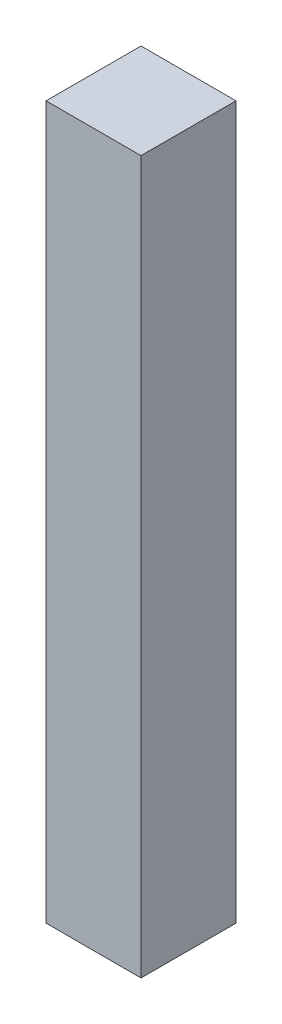
ISO-10303-21;
HEADER;
FILE_DESCRIPTION(('STEP AP214'),'2;1');
FILE_NAME('part.step','',(''),(''),'','','');
FILE_SCHEMA(('AUTOMOTIVE_DESIGN { 1 0 10303 214 1 1 1 1 }'));
ENDSEC;
DATA;
#1=APPLICATION_CONTEXT('core data for automotive mechanical design processes');
#2=APPLICATION_PROTOCOL_DEFINITION('international standard','automotive_design',2000,#1);
#3=PRODUCT_CONTEXT('',#1,'mechanical');
#4=PRODUCT('Part','Part','',(#3));
#5=PRODUCT_RELATED_PRODUCT_CATEGORY('part','',(#4));
#6=PRODUCT_DEFINITION_FORMATION('','',#4);
#7=PRODUCT_DEFINITION_CONTEXT('part definition',#1,'design');
#8=PRODUCT_DEFINITION('design','',#6,#7);
#9=PRODUCT_DEFINITION_SHAPE('','',#8);
#10=(LENGTH_UNIT() NAMED_UNIT(*) SI_UNIT(.MILLI.,.METRE.));
#11=(NAMED_UNIT(*) PLANE_ANGLE_UNIT() SI_UNIT($,.RADIAN.));
#12=(NAMED_UNIT(*) SI_UNIT($,.STERADIAN.) SOLID_ANGLE_UNIT());
#13=UNCERTAINTY_MEASURE_WITH_UNIT(LENGTH_MEASURE(1.E-05),#10,'distance_accuracy_value','');
#14=(GEOMETRIC_REPRESENTATION_CONTEXT(3) GLOBAL_UNCERTAINTY_ASSIGNED_CONTEXT((#13)) GLOBAL_UNIT_ASSIGNED_CONTEXT((#10,
#11,#12)) REPRESENTATION_CONTEXT('',''));
#15=CARTESIAN_POINT('',(0.,0.,0.));
#16=DIRECTION('',(0.,0.,1.));
#17=DIRECTION('',(1.,0.,0.));
#18=AXIS2_PLACEMENT_3D('',#15,#16,#17);
#19=CARTESIAN_POINT('',(-2.54,38.1,2.54));
#20=DIRECTION('',(-1.,0.,0.));
#21=DIRECTION('',(0.,0.,1.));
#22=AXIS2_PLACEMENT_3D('',#19,#20,#21);
#23=PLANE('',#22);
#24=DIRECTION('',(0.,0.,-1.));
#25=VECTOR('',#24,1.);
#26=CARTESIAN_POINT('',(-2.54,0.,2.54));
#27=LINE('',#26,#25);
#28=CARTESIAN_POINT('',(-2.54,0.,2.54));
#29=VERTEX_POINT('',#28);
#30=CARTESIAN_POINT('',(-2.54,0.,-2.54));
#31=VERTEX_POINT('',#30);
#32=EDGE_CURVE('E98',#29,#31,#27,.T.);
#33=ORIENTED_EDGE('',*,*,#32,.F.);
#34=DIRECTION('',(0.,-1.,0.));
#35=VECTOR('',#34,1.);
#36=CARTESIAN_POINT('',(-2.54,38.1,2.54));
#37=LINE('',#36,#35);
#38=CARTESIAN_POINT('',(-2.54,38.1,2.54));
#39=VERTEX_POINT('',#38);
#40=EDGE_CURVE('E11',#39,#29,#37,.T.);
#41=ORIENTED_EDGE('',*,*,#40,.F.);
#42=DIRECTION('',(0.,0.,-1.));
#43=VECTOR('',#42,1.);
#44=CARTESIAN_POINT('',(-2.54,38.1,2.54));
#45=LINE('',#44,#43);
#46=CARTESIAN_POINT('',(-2.53999999999999,38.1,-2.54));
#47=VERTEX_POINT('',#46);
#48=EDGE_CURVE('E93',#39,#47,#45,.T.);
#49=ORIENTED_EDGE('',*,*,#48,.T.);
#50=DIRECTION('',(0.,-1.,0.));
#51=VECTOR('',#50,1.);
#52=CARTESIAN_POINT('',(-2.53999999999999,38.1,-2.54));
#53=LINE('',#52,#51);
#54=EDGE_CURVE('E36',#47,#31,#53,.T.);
#55=ORIENTED_EDGE('',*,*,#54,.T.);
#56=EDGE_LOOP('',(#33,#41,#49,#55));
#57=FACE_BOUND('',#56,.T.);
#58=ADVANCED_FACE('F33',(#57),#23,.T.);
#59=CARTESIAN_POINT('',(-2.54,38.1,2.54));
#60=DIRECTION('',(0.,0.,-1.));
#61=DIRECTION('',(-1.,0.,0.));
#62=AXIS2_PLACEMENT_3D('',#59,#60,#61);
#63=PLANE('',#62);
#64=DIRECTION('',(1.,0.,0.));
#65=VECTOR('',#64,1.);
#66=CARTESIAN_POINT('',(-2.54,0.,2.54));
#67=LINE('',#66,#65);
#68=CARTESIAN_POINT('',(2.54,0.,2.54));
#69=VERTEX_POINT('',#68);
#70=EDGE_CURVE('E66',#29,#69,#67,.T.);
#71=ORIENTED_EDGE('',*,*,#70,.T.);
#72=DIRECTION('',(0.,-1.,0.));
#73=VECTOR('',#72,1.);
#74=CARTESIAN_POINT('',(2.54,38.1,2.54));
#75=LINE('',#74,#73);
#76=CARTESIAN_POINT('',(2.54,38.1,2.54));
#77=VERTEX_POINT('',#76);
#78=EDGE_CURVE('E42',#77,#69,#75,.T.);
#79=ORIENTED_EDGE('',*,*,#78,.F.);
#80=DIRECTION('',(1.,0.,0.));
#81=VECTOR('',#80,1.);
#82=CARTESIAN_POINT('',(-2.54,38.1,2.54));
#83=LINE('',#82,#81);
#84=EDGE_CURVE('E83',#39,#77,#83,.T.);
#85=ORIENTED_EDGE('',*,*,#84,.F.);
#86=ORIENTED_EDGE('',*,*,#40,.T.);
#87=EDGE_LOOP('',(#71,#79,#85,#86));
#88=FACE_BOUND('',#87,.T.);
#89=ADVANCED_FACE('F108',(#88),#63,.F.);
#90=CARTESIAN_POINT('',(2.54,38.1,2.54));
#91=DIRECTION('',(-1.,0.,0.));
#92=DIRECTION('',(0.,0.,1.));
#93=AXIS2_PLACEMENT_3D('',#90,#91,#92);
#94=PLANE('',#93);
#95=DIRECTION('',(0.,0.,-1.));
#96=VECTOR('',#95,1.);
#97=CARTESIAN_POINT('',(2.54,0.,2.54));
#98=LINE('',#97,#96);
#99=CARTESIAN_POINT('',(2.54,0.,-2.54));
#100=VERTEX_POINT('',#99);
#101=EDGE_CURVE('E90',#69,#100,#98,.T.);
#102=ORIENTED_EDGE('',*,*,#101,.T.);
#103=DIRECTION('',(0.,-1.,0.));
#104=VECTOR('',#103,1.);
#105=CARTESIAN_POINT('',(2.54000000000001,38.1,-2.54));
#106=LINE('',#105,#104);
#107=CARTESIAN_POINT('',(2.54000000000001,38.1,-2.54));
#108=VERTEX_POINT('',#107);
#109=EDGE_CURVE('E87',#108,#100,#106,.T.);
#110=ORIENTED_EDGE('',*,*,#109,.F.);
#111=DIRECTION('',(0.,0.,-1.));
#112=VECTOR('',#111,1.);
#113=CARTESIAN_POINT('',(2.54,38.1,2.54));
#114=LINE('',#113,#112);
#115=EDGE_CURVE('E78',#77,#108,#114,.T.);
#116=ORIENTED_EDGE('',*,*,#115,.F.);
#117=ORIENTED_EDGE('',*,*,#78,.T.);
#118=EDGE_LOOP('',(#102,#110,#116,#117));
#119=FACE_BOUND('',#118,.T.);
#120=ADVANCED_FACE('F88',(#119),#94,.F.);
#121=CARTESIAN_POINT('',(-2.53999999999999,38.1,-2.54));
#122=DIRECTION('',(0.,0.,-1.));
#123=DIRECTION('',(-1.,0.,0.));
#124=AXIS2_PLACEMENT_3D('',#121,#122,#123);
#125=PLANE('',#124);
#126=DIRECTION('',(1.,0.,0.));
#127=VECTOR('',#126,1.);
#128=CARTESIAN_POINT('',(-2.54,0.,-2.54));
#129=LINE('',#128,#127);
#130=EDGE_CURVE('E101',#31,#100,#129,.T.);
#131=ORIENTED_EDGE('',*,*,#130,.F.);
#132=ORIENTED_EDGE('',*,*,#54,.F.);
#133=DIRECTION('',(1.,0.,0.));
#134=VECTOR('',#133,1.);
#135=CARTESIAN_POINT('',(-2.53999999999999,38.1,-2.54));
#136=LINE('',#135,#134);
#137=EDGE_CURVE('E82',#47,#108,#136,.T.);
#138=ORIENTED_EDGE('',*,*,#137,.T.);
#139=ORIENTED_EDGE('',*,*,#109,.T.);
#140=EDGE_LOOP('',(#131,#132,#138,#139));
#141=FACE_BOUND('',#140,.T.);
#142=ADVANCED_FACE('F92',(#141),#125,.T.);
#143=CARTESIAN_POINT('',(0.,38.1,0.));
#144=DIRECTION('',(0.,-1.,0.));
#145=DIRECTION('',(0.,0.,-1.));
#146=AXIS2_PLACEMENT_3D('',#143,#144,#145);
#147=PLANE('',#146);
#148=ORIENTED_EDGE('',*,*,#48,.F.);
#149=ORIENTED_EDGE('',*,*,#84,.T.);
#150=ORIENTED_EDGE('',*,*,#115,.T.);
#151=ORIENTED_EDGE('',*,*,#137,.F.);
#152=EDGE_LOOP('',(#148,#149,#150,#151));
#153=FACE_BOUND('',#152,.T.);
#154=ADVANCED_FACE('F81',(#153),#147,.F.);
#155=CARTESIAN_POINT('',(0.,0.,0.));
#156=DIRECTION('',(0.,-1.,0.));
#157=DIRECTION('',(0.,0.,-1.));
#158=AXIS2_PLACEMENT_3D('',#155,#156,#157);
#159=PLANE('',#158);
#160=ORIENTED_EDGE('',*,*,#32,.T.);
#161=ORIENTED_EDGE('',*,*,#130,.T.);
#162=ORIENTED_EDGE('',*,*,#101,.F.);
#163=ORIENTED_EDGE('',*,*,#70,.F.);
#164=EDGE_LOOP('',(#160,#161,#162,#163));
#165=FACE_BOUND('',#164,.T.);
#166=ADVANCED_FACE('F106',(#165),#159,.T.);
#167=CLOSED_SHELL('',(#58,#89,#120,#142,#154,#166));
#168=MANIFOLD_SOLID_BREP('B2',#167);
#169=ADVANCED_BREP_SHAPE_REPRESENTATION('',(#18,#168),#14);
#170=SHAPE_DEFINITION_REPRESENTATION(#9,#169);
ENDSEC;
END-ISO-10303-21;
